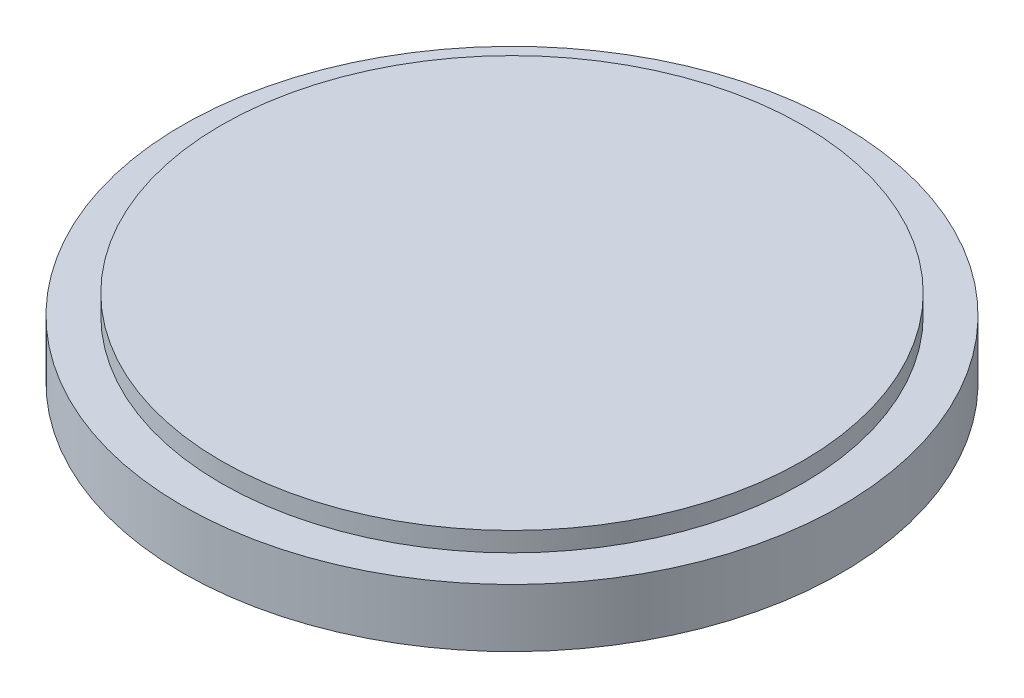
ISO-10303-21;
HEADER;
FILE_DESCRIPTION(('STEP AP214'),'2;1');
FILE_NAME('part.step','',(''),(''),'','','');
FILE_SCHEMA(('AUTOMOTIVE_DESIGN { 1 0 10303 214 1 1 1 1 }'));
ENDSEC;
DATA;
#1=APPLICATION_CONTEXT('core data for automotive mechanical design processes');
#2=APPLICATION_PROTOCOL_DEFINITION('international standard','automotive_design',2000,#1);
#3=PRODUCT_CONTEXT('',#1,'mechanical');
#4=PRODUCT('Part','Part','',(#3));
#5=PRODUCT_RELATED_PRODUCT_CATEGORY('part','',(#4));
#6=PRODUCT_DEFINITION_FORMATION('','',#4);
#7=PRODUCT_DEFINITION_CONTEXT('part definition',#1,'design');
#8=PRODUCT_DEFINITION('design','',#6,#7);
#9=PRODUCT_DEFINITION_SHAPE('','',#8);
#10=(LENGTH_UNIT() NAMED_UNIT(*) SI_UNIT(.MILLI.,.METRE.));
#11=(NAMED_UNIT(*) PLANE_ANGLE_UNIT() SI_UNIT($,.RADIAN.));
#12=(NAMED_UNIT(*) SI_UNIT($,.STERADIAN.) SOLID_ANGLE_UNIT());
#13=UNCERTAINTY_MEASURE_WITH_UNIT(LENGTH_MEASURE(1.E-05),#10,'distance_accuracy_value','');
#14=(GEOMETRIC_REPRESENTATION_CONTEXT(3) GLOBAL_UNCERTAINTY_ASSIGNED_CONTEXT((#13)) GLOBAL_UNIT_ASSIGNED_CONTEXT((#10,
#11,#12)) REPRESENTATION_CONTEXT('',''));
#15=CARTESIAN_POINT('',(0.,0.,0.));
#16=DIRECTION('',(0.,0.,1.));
#17=DIRECTION('',(1.,0.,0.));
#18=AXIS2_PLACEMENT_3D('',#15,#16,#17);
#19=CARTESIAN_POINT('',(0.,5.,0.));
#20=DIRECTION('',(0.,-1.,0.));
#21=DIRECTION('',(0.,0.,-1.));
#22=AXIS2_PLACEMENT_3D('',#19,#20,#21);
#23=CYLINDRICAL_SURFACE('',#22,75.);
#24=CARTESIAN_POINT('',(0.,5.,0.));
#25=DIRECTION('',(0.,1.,0.));
#26=DIRECTION('',(0.,0.,1.));
#27=AXIS2_PLACEMENT_3D('',#24,#25,#26);
#28=CIRCLE('',#27,75.);
#29=CARTESIAN_POINT('',(0.,5.,75.));
#30=VERTEX_POINT('',#29);
#31=EDGE_CURVE('E10',#30,#30,#28,.T.);
#32=ORIENTED_EDGE('',*,*,#31,.F.);
#33=EDGE_LOOP('',(#32));
#34=FACE_BOUND('',#33,.T.);
#35=CARTESIAN_POINT('',(0.,0.,0.));
#36=DIRECTION('',(0.,1.,0.));
#37=DIRECTION('',(0.,0.,1.));
#38=AXIS2_PLACEMENT_3D('',#35,#36,#37);
#39=CIRCLE('',#38,75.);
#40=CARTESIAN_POINT('',(0.,0.,75.));
#41=VERTEX_POINT('',#40);
#42=EDGE_CURVE('E42',#41,#41,#39,.T.);
#43=ORIENTED_EDGE('',*,*,#42,.T.);
#44=EDGE_LOOP('',(#43));
#45=FACE_BOUND('',#44,.T.);
#46=ADVANCED_FACE('F39',(#34,#45),#23,.T.);
#47=CARTESIAN_POINT('',(0.,5.,0.));
#48=DIRECTION('',(0.,1.,0.));
#49=DIRECTION('',(0.,0.,1.));
#50=AXIS2_PLACEMENT_3D('',#47,#48,#49);
#51=PLANE('',#50);
#52=ORIENTED_EDGE('',*,*,#31,.T.);
#53=EDGE_LOOP('',(#52));
#54=FACE_BOUND('',#53,.T.);
#55=ADVANCED_FACE('F66',(#54),#51,.T.);
#56=CARTESIAN_POINT('',(0.,-15.,0.));
#57=DIRECTION('',(0.,1.,0.));
#58=DIRECTION('',(0.,0.,1.));
#59=AXIS2_PLACEMENT_3D('',#56,#57,#58);
#60=CYLINDRICAL_SURFACE('',#59,85.);
#61=CARTESIAN_POINT('',(0.,-15.,0.));
#62=DIRECTION('',(0.,-1.,0.));
#63=DIRECTION('',(0.,0.,-1.));
#64=AXIS2_PLACEMENT_3D('',#61,#62,#63);
#65=CIRCLE('',#64,85.);
#66=CARTESIAN_POINT('',(0.,-15.,-85.));
#67=VERTEX_POINT('',#66);
#68=EDGE_CURVE('E51',#67,#67,#65,.T.);
#69=ORIENTED_EDGE('',*,*,#68,.F.);
#70=EDGE_LOOP('',(#69));
#71=FACE_BOUND('',#70,.T.);
#72=CARTESIAN_POINT('',(0.,0.,0.));
#73=DIRECTION('',(0.,-1.,0.));
#74=DIRECTION('',(0.,0.,-1.));
#75=AXIS2_PLACEMENT_3D('',#72,#73,#74);
#76=CIRCLE('',#75,85.);
#77=CARTESIAN_POINT('',(0.,0.,-85.));
#78=VERTEX_POINT('',#77);
#79=EDGE_CURVE('E53',#78,#78,#76,.T.);
#80=ORIENTED_EDGE('',*,*,#79,.T.);
#81=EDGE_LOOP('',(#80));
#82=FACE_BOUND('',#81,.T.);
#83=ADVANCED_FACE('F63',(#71,#82),#60,.T.);
#84=CARTESIAN_POINT('',(0.,-15.,0.));
#85=DIRECTION('',(0.,-1.,0.));
#86=DIRECTION('',(0.,0.,-1.));
#87=AXIS2_PLACEMENT_3D('',#84,#85,#86);
#88=PLANE('',#87);
#89=ORIENTED_EDGE('',*,*,#68,.T.);
#90=EDGE_LOOP('',(#89));
#91=FACE_BOUND('',#90,.T.);
#92=ADVANCED_FACE('F61',(#91),#88,.T.);
#93=CARTESIAN_POINT('',(0.,0.,0.));
#94=DIRECTION('',(0.,-1.,0.));
#95=DIRECTION('',(0.,0.,-1.));
#96=AXIS2_PLACEMENT_3D('',#93,#94,#95);
#97=PLANE('',#96);
#98=ORIENTED_EDGE('',*,*,#42,.F.);
#99=EDGE_LOOP('',(#98));
#100=FACE_BOUND('',#99,.T.);
#101=ORIENTED_EDGE('',*,*,#79,.F.);
#102=EDGE_LOOP('',(#101));
#103=FACE_BOUND('',#102,.T.);
#104=ADVANCED_FACE('F70',(#100,#103),#97,.F.);
#105=CLOSED_SHELL('',(#46,#55,#83,#92,#104));
#106=MANIFOLD_SOLID_BREP('B2',#105);
#107=ADVANCED_BREP_SHAPE_REPRESENTATION('',(#18,#106),#14);
#108=SHAPE_DEFINITION_REPRESENTATION(#9,#107);
ENDSEC;
END-ISO-10303-21;
